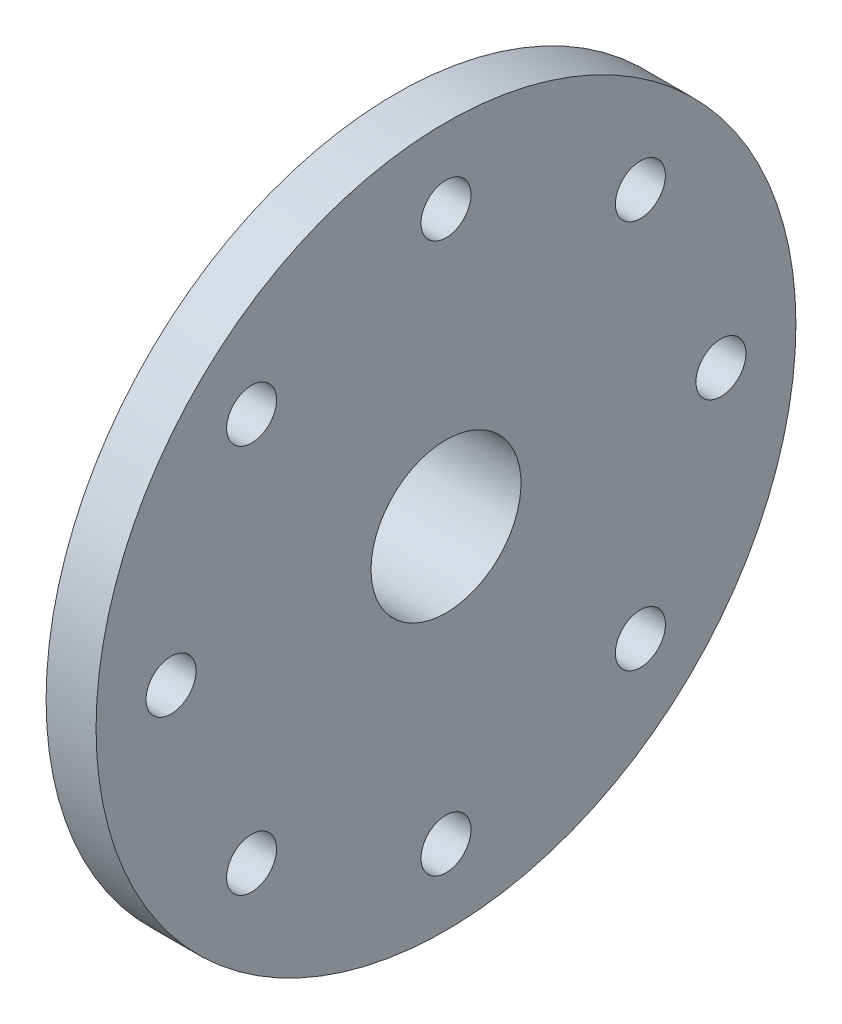
ISO-10303-21;
HEADER;
FILE_DESCRIPTION(('STEP AP214'),'2;1');
FILE_NAME('part.step','',(''),(''),'','','');
FILE_SCHEMA(('AUTOMOTIVE_DESIGN { 1 0 10303 214 1 1 1 1 }'));
ENDSEC;
DATA;
#1=APPLICATION_CONTEXT('core data for automotive mechanical design processes');
#2=APPLICATION_PROTOCOL_DEFINITION('international standard','automotive_design',2000,#1);
#3=PRODUCT_CONTEXT('',#1,'mechanical');
#4=PRODUCT('Part','Part','',(#3));
#5=PRODUCT_RELATED_PRODUCT_CATEGORY('part','',(#4));
#6=PRODUCT_DEFINITION_FORMATION('','',#4);
#7=PRODUCT_DEFINITION_CONTEXT('part definition',#1,'design');
#8=PRODUCT_DEFINITION('design','',#6,#7);
#9=PRODUCT_DEFINITION_SHAPE('','',#8);
#10=(LENGTH_UNIT() NAMED_UNIT(*) SI_UNIT(.MILLI.,.METRE.));
#11=(NAMED_UNIT(*) PLANE_ANGLE_UNIT() SI_UNIT($,.RADIAN.));
#12=(NAMED_UNIT(*) SI_UNIT($,.STERADIAN.) SOLID_ANGLE_UNIT());
#13=UNCERTAINTY_MEASURE_WITH_UNIT(LENGTH_MEASURE(1.E-05),#10,'distance_accuracy_value','');
#14=(GEOMETRIC_REPRESENTATION_CONTEXT(3) GLOBAL_UNCERTAINTY_ASSIGNED_CONTEXT((#13)) GLOBAL_UNIT_ASSIGNED_CONTEXT((#10,
#11,#12)) REPRESENTATION_CONTEXT('',''));
#15=CARTESIAN_POINT('',(0.,0.,0.));
#16=DIRECTION('',(0.,0.,1.));
#17=DIRECTION('',(1.,0.,0.));
#18=AXIS2_PLACEMENT_3D('',#15,#16,#17);
#19=CARTESIAN_POINT('',(-5.,1.5,0.));
#20=DIRECTION('',(1.,0.,0.));
#21=DIRECTION('',(0.,0.,-1.));
#22=AXIS2_PLACEMENT_3D('',#19,#20,#21);
#23=PLANE('',#22);
#24=CARTESIAN_POINT('',(-5.,0.,0.));
#25=DIRECTION('',(-1.,0.,0.));
#26=DIRECTION('',(0.,0.,1.));
#27=AXIS2_PLACEMENT_3D('',#24,#25,#26);
#28=CIRCLE('',#27,1.5);
#29=CARTESIAN_POINT('',(-5.,0.,1.5));
#30=VERTEX_POINT('',#29);
#31=EDGE_CURVE('E42',#30,#30,#28,.T.);
#32=ORIENTED_EDGE('',*,*,#31,.F.);
#33=EDGE_LOOP('',(#32));
#34=FACE_BOUND('',#33,.T.);
#35=CARTESIAN_POINT('',(-5.,0.,0.));
#36=DIRECTION('',(-1.,0.,0.));
#37=DIRECTION('',(0.,0.,1.));
#38=AXIS2_PLACEMENT_3D('',#35,#36,#37);
#39=CIRCLE('',#38,3.75);
#40=CARTESIAN_POINT('',(-5.,0.,3.75));
#41=VERTEX_POINT('',#40);
#42=EDGE_CURVE('E10',#41,#41,#39,.T.);
#43=ORIENTED_EDGE('',*,*,#42,.T.);
#44=EDGE_LOOP('',(#43));
#45=FACE_BOUND('',#44,.T.);
#46=ADVANCED_FACE('F14',(#34,#45),#23,.F.);
#47=CARTESIAN_POINT('',(0.,0.,0.));
#48=DIRECTION('',(-1.,0.,0.));
#49=DIRECTION('',(0.,0.,1.));
#50=AXIS2_PLACEMENT_3D('',#47,#48,#49);
#51=CYLINDRICAL_SURFACE('',#50,3.75);
#52=ORIENTED_EDGE('',*,*,#42,.F.);
#53=EDGE_LOOP('',(#52));
#54=FACE_BOUND('',#53,.T.);
#55=CARTESIAN_POINT('',(-2.,0.,0.));
#56=DIRECTION('',(-1.,0.,0.));
#57=DIRECTION('',(0.,0.,1.));
#58=AXIS2_PLACEMENT_3D('',#55,#56,#57);
#59=CIRCLE('',#58,3.75);
#60=CARTESIAN_POINT('',(-2.,0.,3.75));
#61=VERTEX_POINT('',#60);
#62=EDGE_CURVE('E20',#61,#61,#59,.T.);
#63=ORIENTED_EDGE('',*,*,#62,.T.);
#64=EDGE_LOOP('',(#63));
#65=FACE_BOUND('',#64,.T.);
#66=ADVANCED_FACE('F140',(#54,#65),#51,.T.);
#67=CARTESIAN_POINT('',(-2.,3.75,0.));
#68=DIRECTION('',(1.,0.,0.));
#69=DIRECTION('',(0.,0.,-1.));
#70=AXIS2_PLACEMENT_3D('',#67,#68,#69);
#71=PLANE('',#70);
#72=CARTESIAN_POINT('',(-2.,7.77817459305212,7.77817459305193));
#73=DIRECTION('',(1.,0.,0.));
#74=DIRECTION('',(0.,0.,-1.));
#75=AXIS2_PLACEMENT_3D('',#72,#73,#74);
#76=CIRCLE('',#75,1.);
#77=CARTESIAN_POINT('',(-2.,7.77817459305212,6.77817459305193));
#78=VERTEX_POINT('',#77);
#79=EDGE_CURVE('E87',#78,#78,#76,.T.);
#80=ORIENTED_EDGE('',*,*,#79,.T.);
#81=EDGE_LOOP('',(#80));
#82=FACE_BOUND('',#81,.T.);
#83=CARTESIAN_POINT('',(-2.,1.15218884181823E-13,11.));
#84=DIRECTION('',(1.,0.,0.));
#85=DIRECTION('',(0.,0.,-1.));
#86=AXIS2_PLACEMENT_3D('',#83,#84,#85);
#87=CIRCLE('',#86,1.);
#88=CARTESIAN_POINT('',(-2.,1.15218884181823E-13,10.));
#89=VERTEX_POINT('',#88);
#90=EDGE_CURVE('E81',#89,#89,#87,.T.);
#91=ORIENTED_EDGE('',*,*,#90,.T.);
#92=EDGE_LOOP('',(#91));
#93=FACE_BOUND('',#92,.T.);
#94=CARTESIAN_POINT('',(-2.,-7.77817459305195,7.77817459305209));
#95=DIRECTION('',(1.,0.,0.));
#96=DIRECTION('',(0.,0.,-1.));
#97=AXIS2_PLACEMENT_3D('',#94,#95,#96);
#98=CIRCLE('',#97,1.);
#99=CARTESIAN_POINT('',(-2.,-7.77817459305195,6.77817459305209));
#100=VERTEX_POINT('',#99);
#101=EDGE_CURVE('E75',#100,#100,#98,.T.);
#102=ORIENTED_EDGE('',*,*,#101,.T.);
#103=EDGE_LOOP('',(#102));
#104=FACE_BOUND('',#103,.T.);
#105=CARTESIAN_POINT('',(-2.,-11.,0.));
#106=DIRECTION('',(1.,0.,0.));
#107=DIRECTION('',(0.,0.,-1.));
#108=AXIS2_PLACEMENT_3D('',#105,#106,#107);
#109=CIRCLE('',#108,1.);
#110=CARTESIAN_POINT('',(-2.,-11.,-1.));
#111=VERTEX_POINT('',#110);
#112=EDGE_CURVE('E69',#111,#111,#109,.T.);
#113=ORIENTED_EDGE('',*,*,#112,.T.);
#114=EDGE_LOOP('',(#113));
#115=FACE_BOUND('',#114,.T.);
#116=CARTESIAN_POINT('',(-2.,-7.77817459305206,-7.77817459305198));
#117=DIRECTION('',(1.,0.,0.));
#118=DIRECTION('',(0.,0.,-1.));
#119=AXIS2_PLACEMENT_3D('',#116,#117,#118);
#120=CIRCLE('',#119,1.);
#121=CARTESIAN_POINT('',(-2.,-7.77817459305206,-8.77817459305198));
#122=VERTEX_POINT('',#121);
#123=EDGE_CURVE('E63',#122,#122,#120,.T.);
#124=ORIENTED_EDGE('',*,*,#123,.T.);
#125=EDGE_LOOP('',(#124));
#126=FACE_BOUND('',#125,.T.);
#127=CARTESIAN_POINT('',(-2.,0.,-11.));
#128=DIRECTION('',(1.,0.,0.));
#129=DIRECTION('',(0.,0.,-1.));
#130=AXIS2_PLACEMENT_3D('',#127,#128,#129);
#131=CIRCLE('',#130,1.);
#132=CARTESIAN_POINT('',(-2.,0.,-12.));
#133=VERTEX_POINT('',#132);
#134=EDGE_CURVE('E57',#133,#133,#131,.T.);
#135=ORIENTED_EDGE('',*,*,#134,.T.);
#136=EDGE_LOOP('',(#135));
#137=FACE_BOUND('',#136,.T.);
#138=CARTESIAN_POINT('',(-2.,7.77817459305201,-7.77817459305204));
#139=DIRECTION('',(1.,0.,0.));
#140=DIRECTION('',(0.,0.,-1.));
#141=AXIS2_PLACEMENT_3D('',#138,#139,#140);
#142=CIRCLE('',#141,1.);
#143=CARTESIAN_POINT('',(-2.,7.77817459305201,-8.77817459305204));
#144=VERTEX_POINT('',#143);
#145=EDGE_CURVE('E51',#144,#144,#142,.T.);
#146=ORIENTED_EDGE('',*,*,#145,.T.);
#147=EDGE_LOOP('',(#146));
#148=FACE_BOUND('',#147,.T.);
#149=CARTESIAN_POINT('',(-2.,11.,0.));
#150=DIRECTION('',(1.,0.,0.));
#151=DIRECTION('',(0.,0.,-1.));
#152=AXIS2_PLACEMENT_3D('',#149,#150,#151);
#153=CIRCLE('',#152,1.);
#154=CARTESIAN_POINT('',(-2.,11.,-1.));
#155=VERTEX_POINT('',#154);
#156=EDGE_CURVE('E45',#155,#155,#153,.T.);
#157=ORIENTED_EDGE('',*,*,#156,.T.);
#158=EDGE_LOOP('',(#157));
#159=FACE_BOUND('',#158,.T.);
#160=ORIENTED_EDGE('',*,*,#62,.F.);
#161=EDGE_LOOP('',(#160));
#162=FACE_BOUND('',#161,.T.);
#163=CARTESIAN_POINT('',(-2.,0.,0.));
#164=DIRECTION('',(-1.,0.,0.));
#165=DIRECTION('',(0.,0.,1.));
#166=AXIS2_PLACEMENT_3D('',#163,#164,#165);
#167=CIRCLE('',#166,14.);
#168=CARTESIAN_POINT('',(-2.,0.,14.));
#169=VERTEX_POINT('',#168);
#170=EDGE_CURVE('E24',#169,#169,#167,.T.);
#171=ORIENTED_EDGE('',*,*,#170,.T.);
#172=EDGE_LOOP('',(#171));
#173=FACE_BOUND('',#172,.T.);
#174=ADVANCED_FACE('F145',(#82,#93,#104,#115,#126,#137,#148,#159,#162,#173),#71,.F.);
#175=CARTESIAN_POINT('',(0.,0.,0.));
#176=DIRECTION('',(-1.,0.,0.));
#177=DIRECTION('',(0.,0.,1.));
#178=AXIS2_PLACEMENT_3D('',#175,#176,#177);
#179=CYLINDRICAL_SURFACE('',#178,14.);
#180=ORIENTED_EDGE('',*,*,#170,.F.);
#181=EDGE_LOOP('',(#180));
#182=FACE_BOUND('',#181,.T.);
#183=CARTESIAN_POINT('',(0.,0.,0.));
#184=DIRECTION('',(-1.,0.,0.));
#185=DIRECTION('',(0.,0.,1.));
#186=AXIS2_PLACEMENT_3D('',#183,#184,#185);
#187=CIRCLE('',#186,14.);
#188=CARTESIAN_POINT('',(0.,0.,14.));
#189=VERTEX_POINT('',#188);
#190=EDGE_CURVE('E28',#189,#189,#187,.T.);
#191=ORIENTED_EDGE('',*,*,#190,.T.);
#192=EDGE_LOOP('',(#191));
#193=FACE_BOUND('',#192,.T.);
#194=ADVANCED_FACE('F101',(#182,#193),#179,.T.);
#195=CARTESIAN_POINT('',(0.,14.,0.));
#196=DIRECTION('',(-1.,0.,0.));
#197=DIRECTION('',(0.,0.,1.));
#198=AXIS2_PLACEMENT_3D('',#195,#196,#197);
#199=PLANE('',#198);
#200=CARTESIAN_POINT('',(0.,7.77817459305212,7.77817459305193));
#201=DIRECTION('',(1.,0.,0.));
#202=DIRECTION('',(0.,0.707106781186539,-0.707106781186556));
#203=AXIS2_PLACEMENT_3D('',#200,#201,#202);
#204=CIRCLE('',#203,1.);
#205=CARTESIAN_POINT('',(0.,8.48528137423866,7.07106781186537));
#206=VERTEX_POINT('',#205);
#207=EDGE_CURVE('E90',#206,#206,#204,.T.);
#208=ORIENTED_EDGE('',*,*,#207,.F.);
#209=EDGE_LOOP('',(#208));
#210=FACE_BOUND('',#209,.T.);
#211=CARTESIAN_POINT('',(0.,1.15218884181823E-13,11.));
#212=DIRECTION('',(1.,0.,0.));
#213=DIRECTION('',(0.,1.,0.));
#214=AXIS2_PLACEMENT_3D('',#211,#212,#213);
#215=CIRCLE('',#214,1.);
#216=CARTESIAN_POINT('',(0.,1.00000000000012,11.));
#217=VERTEX_POINT('',#216);
#218=EDGE_CURVE('E84',#217,#217,#215,.T.);
#219=ORIENTED_EDGE('',*,*,#218,.F.);
#220=EDGE_LOOP('',(#219));
#221=FACE_BOUND('',#220,.T.);
#222=CARTESIAN_POINT('',(0.,-7.77817459305195,7.77817459305209));
#223=DIRECTION('',(1.,0.,0.));
#224=DIRECTION('',(0.,0.707106781186554,0.707106781186541));
#225=AXIS2_PLACEMENT_3D('',#222,#223,#224);
#226=CIRCLE('',#225,1.);
#227=CARTESIAN_POINT('',(0.,-7.0710678118654,8.48528137423863));
#228=VERTEX_POINT('',#227);
#229=EDGE_CURVE('E78',#228,#228,#226,.T.);
#230=ORIENTED_EDGE('',*,*,#229,.F.);
#231=EDGE_LOOP('',(#230));
#232=FACE_BOUND('',#231,.T.);
#233=CARTESIAN_POINT('',(0.,-11.,0.));
#234=DIRECTION('',(1.,0.,0.));
#235=DIRECTION('',(0.,0.,1.));
#236=AXIS2_PLACEMENT_3D('',#233,#234,#235);
#237=CIRCLE('',#236,1.);
#238=CARTESIAN_POINT('',(0.,-11.,1.));
#239=VERTEX_POINT('',#238);
#240=EDGE_CURVE('E72',#239,#239,#237,.T.);
#241=ORIENTED_EDGE('',*,*,#240,.F.);
#242=EDGE_LOOP('',(#241));
#243=FACE_BOUND('',#242,.T.);
#244=CARTESIAN_POINT('',(0.,-7.77817459305206,-7.77817459305198));
#245=DIRECTION('',(1.,0.,0.));
#246=DIRECTION('',(0.,-0.707106781186544,0.707106781186551));
#247=AXIS2_PLACEMENT_3D('',#244,#245,#246);
#248=CIRCLE('',#247,1.);
#249=CARTESIAN_POINT('',(0.,-8.48528137423861,-7.07106781186543));
#250=VERTEX_POINT('',#249);
#251=EDGE_CURVE('E66',#250,#250,#248,.T.);
#252=ORIENTED_EDGE('',*,*,#251,.F.);
#253=EDGE_LOOP('',(#252));
#254=FACE_BOUND('',#253,.T.);
#255=CARTESIAN_POINT('',(0.,0.,-11.));
#256=DIRECTION('',(1.,0.,0.));
#257=DIRECTION('',(0.,-1.,0.));
#258=AXIS2_PLACEMENT_3D('',#255,#256,#257);
#259=CIRCLE('',#258,1.);
#260=CARTESIAN_POINT('',(0.,-1.00000000000004,-11.));
#261=VERTEX_POINT('',#260);
#262=EDGE_CURVE('E60',#261,#261,#259,.T.);
#263=ORIENTED_EDGE('',*,*,#262,.F.);
#264=EDGE_LOOP('',(#263));
#265=FACE_BOUND('',#264,.T.);
#266=CARTESIAN_POINT('',(0.,7.77817459305201,-7.77817459305204));
#267=DIRECTION('',(1.,0.,0.));
#268=DIRECTION('',(0.,-0.707106781186549,-0.707106781186546));
#269=AXIS2_PLACEMENT_3D('',#266,#267,#268);
#270=CIRCLE('',#269,1.);
#271=CARTESIAN_POINT('',(0.,7.07106781186546,-8.48528137423859));
#272=VERTEX_POINT('',#271);
#273=EDGE_CURVE('E54',#272,#272,#270,.T.);
#274=ORIENTED_EDGE('',*,*,#273,.F.);
#275=EDGE_LOOP('',(#274));
#276=FACE_BOUND('',#275,.T.);
#277=CARTESIAN_POINT('',(0.,11.,0.));
#278=DIRECTION('',(1.,0.,0.));
#279=DIRECTION('',(0.,0.,-1.));
#280=AXIS2_PLACEMENT_3D('',#277,#278,#279);
#281=CIRCLE('',#280,1.);
#282=CARTESIAN_POINT('',(0.,11.,-1.));
#283=VERTEX_POINT('',#282);
#284=EDGE_CURVE('E48',#283,#283,#281,.T.);
#285=ORIENTED_EDGE('',*,*,#284,.F.);
#286=EDGE_LOOP('',(#285));
#287=FACE_BOUND('',#286,.T.);
#288=ORIENTED_EDGE('',*,*,#190,.F.);
#289=EDGE_LOOP('',(#288));
#290=FACE_BOUND('',#289,.T.);
#291=CARTESIAN_POINT('',(0.,0.,0.));
#292=DIRECTION('',(-1.,0.,0.));
#293=DIRECTION('',(0.,0.,1.));
#294=AXIS2_PLACEMENT_3D('',#291,#292,#293);
#295=CIRCLE('',#294,3.);
#296=CARTESIAN_POINT('',(0.,0.,3.));
#297=VERTEX_POINT('',#296);
#298=EDGE_CURVE('E33',#297,#297,#295,.T.);
#299=ORIENTED_EDGE('',*,*,#298,.T.);
#300=EDGE_LOOP('',(#299));
#301=FACE_BOUND('',#300,.T.);
#302=ADVANCED_FACE('F97',(#210,#221,#232,#243,#254,#265,#276,#287,#290,#301),#199,.F.);
#303=CARTESIAN_POINT('',(0.,0.,0.));
#304=DIRECTION('',(-1.,0.,0.));
#305=DIRECTION('',(0.,0.,1.));
#306=AXIS2_PLACEMENT_3D('',#303,#304,#305);
#307=CYLINDRICAL_SURFACE('',#306,3.);
#308=ORIENTED_EDGE('',*,*,#298,.F.);
#309=EDGE_LOOP('',(#308));
#310=FACE_BOUND('',#309,.T.);
#311=CARTESIAN_POINT('',(-4.5,0.,0.));
#312=DIRECTION('',(-1.,0.,0.));
#313=DIRECTION('',(0.,0.,1.));
#314=AXIS2_PLACEMENT_3D('',#311,#312,#313);
#315=CIRCLE('',#314,3.);
#316=CARTESIAN_POINT('',(-4.5,0.,3.));
#317=VERTEX_POINT('',#316);
#318=EDGE_CURVE('E36',#317,#317,#315,.T.);
#319=ORIENTED_EDGE('',*,*,#318,.T.);
#320=EDGE_LOOP('',(#319));
#321=FACE_BOUND('',#320,.T.);
#322=ADVANCED_FACE('F100',(#310,#321),#307,.F.);
#323=CARTESIAN_POINT('',(-4.5,3.,0.));
#324=DIRECTION('',(-1.,0.,0.));
#325=DIRECTION('',(0.,0.,1.));
#326=AXIS2_PLACEMENT_3D('',#323,#324,#325);
#327=PLANE('',#326);
#328=ORIENTED_EDGE('',*,*,#318,.F.);
#329=EDGE_LOOP('',(#328));
#330=FACE_BOUND('',#329,.T.);
#331=CARTESIAN_POINT('',(-4.5,0.,0.));
#332=DIRECTION('',(-1.,0.,0.));
#333=DIRECTION('',(0.,0.,1.));
#334=AXIS2_PLACEMENT_3D('',#331,#332,#333);
#335=CIRCLE('',#334,1.5);
#336=CARTESIAN_POINT('',(-4.5,0.,1.5));
#337=VERTEX_POINT('',#336);
#338=EDGE_CURVE('E39',#337,#337,#335,.T.);
#339=ORIENTED_EDGE('',*,*,#338,.T.);
#340=EDGE_LOOP('',(#339));
#341=FACE_BOUND('',#340,.T.);
#342=ADVANCED_FACE('F123',(#330,#341),#327,.F.);
#343=CARTESIAN_POINT('',(0.,0.,0.));
#344=DIRECTION('',(-1.,0.,0.));
#345=DIRECTION('',(0.,0.,1.));
#346=AXIS2_PLACEMENT_3D('',#343,#344,#345);
#347=CYLINDRICAL_SURFACE('',#346,1.5);
#348=ORIENTED_EDGE('',*,*,#338,.F.);
#349=EDGE_LOOP('',(#348));
#350=FACE_BOUND('',#349,.T.);
#351=ORIENTED_EDGE('',*,*,#31,.T.);
#352=EDGE_LOOP('',(#351));
#353=FACE_BOUND('',#352,.T.);
#354=ADVANCED_FACE('F129',(#350,#353),#347,.F.);
#355=CARTESIAN_POINT('',(-5.,11.,0.));
#356=DIRECTION('',(1.,0.,0.));
#357=DIRECTION('',(0.,0.,-1.));
#358=AXIS2_PLACEMENT_3D('',#355,#356,#357);
#359=CYLINDRICAL_SURFACE('',#358,1.);
#360=ORIENTED_EDGE('',*,*,#284,.T.);
#361=EDGE_LOOP('',(#360));
#362=FACE_BOUND('',#361,.T.);
#363=ORIENTED_EDGE('',*,*,#156,.F.);
#364=EDGE_LOOP('',(#363));
#365=FACE_BOUND('',#364,.T.);
#366=ADVANCED_FACE('F135',(#362,#365),#359,.F.);
#367=CARTESIAN_POINT('',(-5.,7.77817459305201,-7.77817459305204));
#368=DIRECTION('',(1.,0.,0.));
#369=DIRECTION('',(0.,0.,-1.));
#370=AXIS2_PLACEMENT_3D('',#367,#368,#369);
#371=CYLINDRICAL_SURFACE('',#370,1.);
#372=ORIENTED_EDGE('',*,*,#273,.T.);
#373=EDGE_LOOP('',(#372));
#374=FACE_BOUND('',#373,.T.);
#375=ORIENTED_EDGE('',*,*,#145,.F.);
#376=EDGE_LOOP('',(#375));
#377=FACE_BOUND('',#376,.T.);
#378=ADVANCED_FACE('F158',(#374,#377),#371,.F.);
#379=CARTESIAN_POINT('',(-5.,0.,-11.));
#380=DIRECTION('',(1.,0.,0.));
#381=DIRECTION('',(0.,0.,-1.));
#382=AXIS2_PLACEMENT_3D('',#379,#380,#381);
#383=CYLINDRICAL_SURFACE('',#382,1.);
#384=ORIENTED_EDGE('',*,*,#262,.T.);
#385=EDGE_LOOP('',(#384));
#386=FACE_BOUND('',#385,.T.);
#387=ORIENTED_EDGE('',*,*,#134,.F.);
#388=EDGE_LOOP('',(#387));
#389=FACE_BOUND('',#388,.T.);
#390=ADVANCED_FACE('F162',(#386,#389),#383,.F.);
#391=CARTESIAN_POINT('',(-5.,-7.77817459305206,-7.77817459305198));
#392=DIRECTION('',(1.,0.,0.));
#393=DIRECTION('',(0.,0.,-1.));
#394=AXIS2_PLACEMENT_3D('',#391,#392,#393);
#395=CYLINDRICAL_SURFACE('',#394,1.);
#396=ORIENTED_EDGE('',*,*,#251,.T.);
#397=EDGE_LOOP('',(#396));
#398=FACE_BOUND('',#397,.T.);
#399=ORIENTED_EDGE('',*,*,#123,.F.);
#400=EDGE_LOOP('',(#399));
#401=FACE_BOUND('',#400,.T.);
#402=ADVANCED_FACE('F166',(#398,#401),#395,.F.);
#403=CARTESIAN_POINT('',(-5.,-11.,0.));
#404=DIRECTION('',(1.,0.,0.));
#405=DIRECTION('',(0.,0.,-1.));
#406=AXIS2_PLACEMENT_3D('',#403,#404,#405);
#407=CYLINDRICAL_SURFACE('',#406,1.);
#408=ORIENTED_EDGE('',*,*,#240,.T.);
#409=EDGE_LOOP('',(#408));
#410=FACE_BOUND('',#409,.T.);
#411=ORIENTED_EDGE('',*,*,#112,.F.);
#412=EDGE_LOOP('',(#411));
#413=FACE_BOUND('',#412,.T.);
#414=ADVANCED_FACE('F170',(#410,#413),#407,.F.);
#415=CARTESIAN_POINT('',(-5.,-7.77817459305195,7.77817459305209));
#416=DIRECTION('',(1.,0.,0.));
#417=DIRECTION('',(0.,0.,-1.));
#418=AXIS2_PLACEMENT_3D('',#415,#416,#417);
#419=CYLINDRICAL_SURFACE('',#418,1.);
#420=ORIENTED_EDGE('',*,*,#229,.T.);
#421=EDGE_LOOP('',(#420));
#422=FACE_BOUND('',#421,.T.);
#423=ORIENTED_EDGE('',*,*,#101,.F.);
#424=EDGE_LOOP('',(#423));
#425=FACE_BOUND('',#424,.T.);
#426=ADVANCED_FACE('F174',(#422,#425),#419,.F.);
#427=CARTESIAN_POINT('',(-5.,1.15218884181823E-13,11.));
#428=DIRECTION('',(1.,0.,0.));
#429=DIRECTION('',(0.,0.,-1.));
#430=AXIS2_PLACEMENT_3D('',#427,#428,#429);
#431=CYLINDRICAL_SURFACE('',#430,1.);
#432=ORIENTED_EDGE('',*,*,#218,.T.);
#433=EDGE_LOOP('',(#432));
#434=FACE_BOUND('',#433,.T.);
#435=ORIENTED_EDGE('',*,*,#90,.F.);
#436=EDGE_LOOP('',(#435));
#437=FACE_BOUND('',#436,.T.);
#438=ADVANCED_FACE('F178',(#434,#437),#431,.F.);
#439=CARTESIAN_POINT('',(-5.,7.77817459305212,7.77817459305193));
#440=DIRECTION('',(1.,0.,0.));
#441=DIRECTION('',(0.,0.,-1.));
#442=AXIS2_PLACEMENT_3D('',#439,#440,#441);
#443=CYLINDRICAL_SURFACE('',#442,1.);
#444=ORIENTED_EDGE('',*,*,#207,.T.);
#445=EDGE_LOOP('',(#444));
#446=FACE_BOUND('',#445,.T.);
#447=ORIENTED_EDGE('',*,*,#79,.F.);
#448=EDGE_LOOP('',(#447));
#449=FACE_BOUND('',#448,.T.);
#450=ADVANCED_FACE('F94',(#446,#449),#443,.F.);
#451=CLOSED_SHELL('',(#46,#66,#174,#194,#302,#322,#342,#354,#366,#378,#390,#402,#414,#426,#438,#450));
#452=MANIFOLD_SOLID_BREP('B1',#451);
#453=ADVANCED_BREP_SHAPE_REPRESENTATION('',(#18,#452),#14);
#454=SHAPE_DEFINITION_REPRESENTATION(#9,#453);
ENDSEC;
END-ISO-10303-21;
